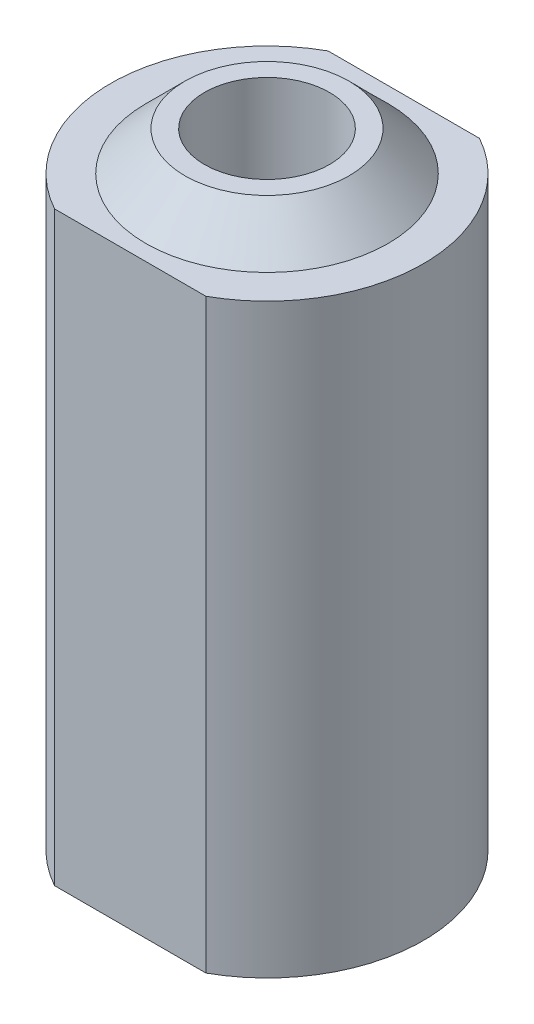
ISO-10303-21;
HEADER;
FILE_DESCRIPTION(('STEP AP214'),'2;1');
FILE_NAME('part.step','',(''),(''),'','','');
FILE_SCHEMA(('AUTOMOTIVE_DESIGN { 1 0 10303 214 1 1 1 1 }'));
ENDSEC;
DATA;
#1=APPLICATION_CONTEXT('core data for automotive mechanical design processes');
#2=APPLICATION_PROTOCOL_DEFINITION('international standard','automotive_design',2000,#1);
#3=PRODUCT_CONTEXT('',#1,'mechanical');
#4=PRODUCT('Part','Part','',(#3));
#5=PRODUCT_RELATED_PRODUCT_CATEGORY('part','',(#4));
#6=PRODUCT_DEFINITION_FORMATION('','',#4);
#7=PRODUCT_DEFINITION_CONTEXT('part definition',#1,'design');
#8=PRODUCT_DEFINITION('design','',#6,#7);
#9=PRODUCT_DEFINITION_SHAPE('','',#8);
#10=(LENGTH_UNIT() NAMED_UNIT(*) SI_UNIT(.MILLI.,.METRE.));
#11=(NAMED_UNIT(*) PLANE_ANGLE_UNIT() SI_UNIT($,.RADIAN.));
#12=(NAMED_UNIT(*) SI_UNIT($,.STERADIAN.) SOLID_ANGLE_UNIT());
#13=UNCERTAINTY_MEASURE_WITH_UNIT(LENGTH_MEASURE(1.E-05),#10,'distance_accuracy_value','');
#14=(GEOMETRIC_REPRESENTATION_CONTEXT(3) GLOBAL_UNCERTAINTY_ASSIGNED_CONTEXT((#13)) GLOBAL_UNIT_ASSIGNED_CONTEXT((#10,
#11,#12)) REPRESENTATION_CONTEXT('',''));
#15=CARTESIAN_POINT('',(0.,0.,0.));
#16=DIRECTION('',(0.,0.,1.));
#17=DIRECTION('',(1.,0.,0.));
#18=AXIS2_PLACEMENT_3D('',#15,#16,#17);
#19=CARTESIAN_POINT('',(0.,15.,0.));
#20=DIRECTION('',(0.,1.,0.));
#21=DIRECTION('',(0.,0.,1.));
#22=AXIS2_PLACEMENT_3D('',#19,#20,#21);
#23=PLANE('',#22);
#24=CARTESIAN_POINT('',(0.,15.,0.));
#25=DIRECTION('',(0.,1.,0.));
#26=DIRECTION('',(0.,0.,1.));
#27=AXIS2_PLACEMENT_3D('',#24,#25,#26);
#28=CIRCLE('',#27,4.);
#29=CARTESIAN_POINT('',(1.93649167310371,15.,3.5));
#30=VERTEX_POINT('',#29);
#31=CARTESIAN_POINT('',(1.93649167310371,15.,-3.5));
#32=VERTEX_POINT('',#31);
#33=EDGE_CURVE('E88',#30,#32,#28,.T.);
#34=ORIENTED_EDGE('',*,*,#33,.T.);
#35=DIRECTION('',(-1.,0.,0.));
#36=VECTOR('',#35,1.);
#37=CARTESIAN_POINT('',(-1.93649167310371,15.,-3.5));
#38=LINE('',#37,#36);
#39=CARTESIAN_POINT('',(-1.93649167310371,15.,-3.5));
#40=VERTEX_POINT('',#39);
#41=EDGE_CURVE('E83',#32,#40,#38,.T.);
#42=ORIENTED_EDGE('',*,*,#41,.T.);
#43=CARTESIAN_POINT('',(0.,15.,0.));
#44=DIRECTION('',(0.,1.,0.));
#45=DIRECTION('',(0.,0.,1.));
#46=AXIS2_PLACEMENT_3D('',#43,#44,#45);
#47=CIRCLE('',#46,4.);
#48=CARTESIAN_POINT('',(-1.93649167310371,15.,3.5));
#49=VERTEX_POINT('',#48);
#50=EDGE_CURVE('E86',#40,#49,#47,.T.);
#51=ORIENTED_EDGE('',*,*,#50,.T.);
#52=DIRECTION('',(1.,0.,0.));
#53=VECTOR('',#52,1.);
#54=CARTESIAN_POINT('',(-1.93649167310371,15.,3.5));
#55=LINE('',#54,#53);
#56=EDGE_CURVE('E52',#49,#30,#55,.T.);
#57=ORIENTED_EDGE('',*,*,#56,.T.);
#58=EDGE_LOOP('',(#34,#42,#51,#57));
#59=FACE_BOUND('',#58,.T.);
#60=CARTESIAN_POINT('',(0.,15.,0.));
#61=DIRECTION('',(0.,1.,0.));
#62=DIRECTION('',(0.,0.,1.));
#63=AXIS2_PLACEMENT_3D('',#60,#61,#62);
#64=CIRCLE('',#63,3.1);
#65=CARTESIAN_POINT('',(0.,15.,3.1));
#66=VERTEX_POINT('',#65);
#67=EDGE_CURVE('E121',#66,#66,#64,.T.);
#68=ORIENTED_EDGE('',*,*,#67,.F.);
#69=EDGE_LOOP('',(#68));
#70=FACE_BOUND('',#69,.T.);
#71=ADVANCED_FACE('F35',(#59,#70),#23,.T.);
#72=CARTESIAN_POINT('',(0.,0.,0.));
#73=DIRECTION('',(0.,1.,0.));
#74=DIRECTION('',(0.,0.,1.));
#75=AXIS2_PLACEMENT_3D('',#72,#73,#74);
#76=PLANE('',#75);
#77=CARTESIAN_POINT('',(0.,0.,0.));
#78=DIRECTION('',(0.,1.,0.));
#79=DIRECTION('',(0.,0.,1.));
#80=AXIS2_PLACEMENT_3D('',#77,#78,#79);
#81=CIRCLE('',#80,4.);
#82=CARTESIAN_POINT('',(1.93649167310371,0.,3.5));
#83=VERTEX_POINT('',#82);
#84=CARTESIAN_POINT('',(1.93649167310371,0.,-3.5));
#85=VERTEX_POINT('',#84);
#86=EDGE_CURVE('E102',#83,#85,#81,.T.);
#87=ORIENTED_EDGE('',*,*,#86,.F.);
#88=DIRECTION('',(1.,0.,0.));
#89=VECTOR('',#88,1.);
#90=CARTESIAN_POINT('',(-1.93649167310371,0.,3.5));
#91=LINE('',#90,#89);
#92=CARTESIAN_POINT('',(-1.93649167310371,0.,3.5));
#93=VERTEX_POINT('',#92);
#94=EDGE_CURVE('E75',#93,#83,#91,.T.);
#95=ORIENTED_EDGE('',*,*,#94,.F.);
#96=CARTESIAN_POINT('',(0.,0.,0.));
#97=DIRECTION('',(0.,1.,0.));
#98=DIRECTION('',(0.,0.,1.));
#99=AXIS2_PLACEMENT_3D('',#96,#97,#98);
#100=CIRCLE('',#99,4.);
#101=CARTESIAN_POINT('',(-1.93649167310371,0.,-3.5));
#102=VERTEX_POINT('',#101);
#103=EDGE_CURVE('E69',#102,#93,#100,.T.);
#104=ORIENTED_EDGE('',*,*,#103,.F.);
#105=DIRECTION('',(-1.,0.,0.));
#106=VECTOR('',#105,1.);
#107=CARTESIAN_POINT('',(-1.93649167310371,0.,-3.5));
#108=LINE('',#107,#106);
#109=EDGE_CURVE('E93',#85,#102,#108,.T.);
#110=ORIENTED_EDGE('',*,*,#109,.F.);
#111=EDGE_LOOP('',(#87,#95,#104,#110));
#112=FACE_BOUND('',#111,.T.);
#113=CARTESIAN_POINT('',(0.,0.,0.));
#114=DIRECTION('',(0.,1.,0.));
#115=DIRECTION('',(0.,0.,1.));
#116=AXIS2_PLACEMENT_3D('',#113,#114,#115);
#117=CIRCLE('',#116,1.6);
#118=CARTESIAN_POINT('',(0.,0.,1.6));
#119=VERTEX_POINT('',#118);
#120=EDGE_CURVE('E105',#119,#119,#117,.T.);
#121=ORIENTED_EDGE('',*,*,#120,.T.);
#122=EDGE_LOOP('',(#121));
#123=FACE_BOUND('',#122,.T.);
#124=ADVANCED_FACE('F114',(#112,#123),#76,.F.);
#125=CARTESIAN_POINT('',(0.,15.,0.));
#126=DIRECTION('',(0.,-1.,0.));
#127=DIRECTION('',(0.,0.,-1.));
#128=AXIS2_PLACEMENT_3D('',#125,#126,#127);
#129=CYLINDRICAL_SURFACE('',#128,4.);
#130=ORIENTED_EDGE('',*,*,#86,.T.);
#131=DIRECTION('',(0.,-1.,0.));
#132=VECTOR('',#131,1.);
#133=CARTESIAN_POINT('',(1.93649167310371,15.,-3.5));
#134=LINE('',#133,#132);
#135=EDGE_CURVE('E44',#32,#85,#134,.T.);
#136=ORIENTED_EDGE('',*,*,#135,.F.);
#137=ORIENTED_EDGE('',*,*,#33,.F.);
#138=DIRECTION('',(0.,-1.,0.));
#139=VECTOR('',#138,1.);
#140=CARTESIAN_POINT('',(1.93649167310371,15.,3.5));
#141=LINE('',#140,#139);
#142=EDGE_CURVE('E98',#30,#83,#141,.T.);
#143=ORIENTED_EDGE('',*,*,#142,.T.);
#144=EDGE_LOOP('',(#130,#136,#137,#143));
#145=FACE_BOUND('',#144,.T.);
#146=ADVANCED_FACE('F112',(#145),#129,.T.);
#147=CARTESIAN_POINT('',(-1.93649167310371,15.,-3.5));
#148=DIRECTION('',(0.,0.,1.));
#149=DIRECTION('',(1.,0.,0.));
#150=AXIS2_PLACEMENT_3D('',#147,#148,#149);
#151=PLANE('',#150);
#152=ORIENTED_EDGE('',*,*,#109,.T.);
#153=DIRECTION('',(0.,-1.,0.));
#154=VECTOR('',#153,1.);
#155=CARTESIAN_POINT('',(-1.93649167310371,15.,-3.5));
#156=LINE('',#155,#154);
#157=EDGE_CURVE('E91',#40,#102,#156,.T.);
#158=ORIENTED_EDGE('',*,*,#157,.F.);
#159=ORIENTED_EDGE('',*,*,#41,.F.);
#160=ORIENTED_EDGE('',*,*,#135,.T.);
#161=EDGE_LOOP('',(#152,#158,#159,#160));
#162=FACE_BOUND('',#161,.T.);
#163=ADVANCED_FACE('F92',(#162),#151,.F.);
#164=CARTESIAN_POINT('',(0.,15.,0.));
#165=DIRECTION('',(0.,-1.,0.));
#166=DIRECTION('',(0.,0.,-1.));
#167=AXIS2_PLACEMENT_3D('',#164,#165,#166);
#168=CYLINDRICAL_SURFACE('',#167,4.);
#169=ORIENTED_EDGE('',*,*,#103,.T.);
#170=DIRECTION('',(0.,-1.,0.));
#171=VECTOR('',#170,1.);
#172=CARTESIAN_POINT('',(-1.93649167310371,15.,3.5));
#173=LINE('',#172,#171);
#174=EDGE_CURVE('E94',#49,#93,#173,.T.);
#175=ORIENTED_EDGE('',*,*,#174,.F.);
#176=ORIENTED_EDGE('',*,*,#50,.F.);
#177=ORIENTED_EDGE('',*,*,#157,.T.);
#178=EDGE_LOOP('',(#169,#175,#176,#177));
#179=FACE_BOUND('',#178,.T.);
#180=ADVANCED_FACE('F96',(#179),#168,.T.);
#181=CARTESIAN_POINT('',(-1.93649167310371,15.,3.5));
#182=DIRECTION('',(0.,0.,-1.));
#183=DIRECTION('',(-1.,0.,0.));
#184=AXIS2_PLACEMENT_3D('',#181,#182,#183);
#185=PLANE('',#184);
#186=ORIENTED_EDGE('',*,*,#94,.T.);
#187=ORIENTED_EDGE('',*,*,#142,.F.);
#188=ORIENTED_EDGE('',*,*,#56,.F.);
#189=ORIENTED_EDGE('',*,*,#174,.T.);
#190=EDGE_LOOP('',(#186,#187,#188,#189));
#191=FACE_BOUND('',#190,.T.);
#192=ADVANCED_FACE('F141',(#191),#185,.F.);
#193=CARTESIAN_POINT('',(0.,15.,0.));
#194=DIRECTION('',(0.,-1.,0.));
#195=DIRECTION('',(0.,0.,-1.));
#196=AXIS2_PLACEMENT_3D('',#193,#194,#195);
#197=CYLINDRICAL_SURFACE('',#196,1.6);
#198=ORIENTED_EDGE('',*,*,#120,.F.);
#199=EDGE_LOOP('',(#198));
#200=FACE_BOUND('',#199,.T.);
#201=CARTESIAN_POINT('',(0.,16.,0.));
#202=DIRECTION('',(0.,1.,0.));
#203=DIRECTION('',(0.,0.,1.));
#204=AXIS2_PLACEMENT_3D('',#201,#202,#203);
#205=CIRCLE('',#204,1.6);
#206=CARTESIAN_POINT('',(0.,16.,1.6));
#207=VERTEX_POINT('',#206);
#208=EDGE_CURVE('E124',#207,#207,#205,.T.);
#209=ORIENTED_EDGE('',*,*,#208,.T.);
#210=EDGE_LOOP('',(#209));
#211=FACE_BOUND('',#210,.T.);
#212=ADVANCED_FACE('F130',(#200,#211),#197,.F.);
#213=CARTESIAN_POINT('',(0.,16.,0.));
#214=DIRECTION('',(0.,1.,0.));
#215=DIRECTION('',(0.,0.,1.));
#216=AXIS2_PLACEMENT_3D('',#213,#214,#215);
#217=PLANE('',#216);
#218=CARTESIAN_POINT('',(0.,16.,0.));
#219=DIRECTION('',(0.,1.,0.));
#220=DIRECTION('',(0.,0.,1.));
#221=AXIS2_PLACEMENT_3D('',#218,#219,#220);
#222=CIRCLE('',#221,2.1);
#223=CARTESIAN_POINT('',(0.,16.,2.1));
#224=VERTEX_POINT('',#223);
#225=EDGE_CURVE('E11',#224,#224,#222,.T.);
#226=ORIENTED_EDGE('',*,*,#225,.T.);
#227=EDGE_LOOP('',(#226));
#228=FACE_BOUND('',#227,.T.);
#229=ORIENTED_EDGE('',*,*,#208,.F.);
#230=EDGE_LOOP('',(#229));
#231=FACE_BOUND('',#230,.T.);
#232=ADVANCED_FACE('F132',(#228,#231),#217,.T.);
#233=CARTESIAN_POINT('',(0.,16.,0.));
#234=DIRECTION('',(0.,-1.,0.));
#235=DIRECTION('',(0.,0.,-1.));
#236=AXIS2_PLACEMENT_3D('',#233,#234,#235);
#237=CONICAL_SURFACE('',#236,2.1,0.785398163397448);
#238=ORIENTED_EDGE('',*,*,#67,.T.);
#239=EDGE_LOOP('',(#238));
#240=FACE_BOUND('',#239,.T.);
#241=ORIENTED_EDGE('',*,*,#225,.F.);
#242=EDGE_LOOP('',(#241));
#243=FACE_BOUND('',#242,.T.);
#244=ADVANCED_FACE('F37',(#240,#243),#237,.T.);
#245=CLOSED_SHELL('',(#71,#124,#146,#163,#180,#192,#212,#232,#244));
#246=MANIFOLD_SOLID_BREP('B2',#245);
#247=ADVANCED_BREP_SHAPE_REPRESENTATION('',(#18,#246),#14);
#248=SHAPE_DEFINITION_REPRESENTATION(#9,#247);
ENDSEC;
END-ISO-10303-21;
